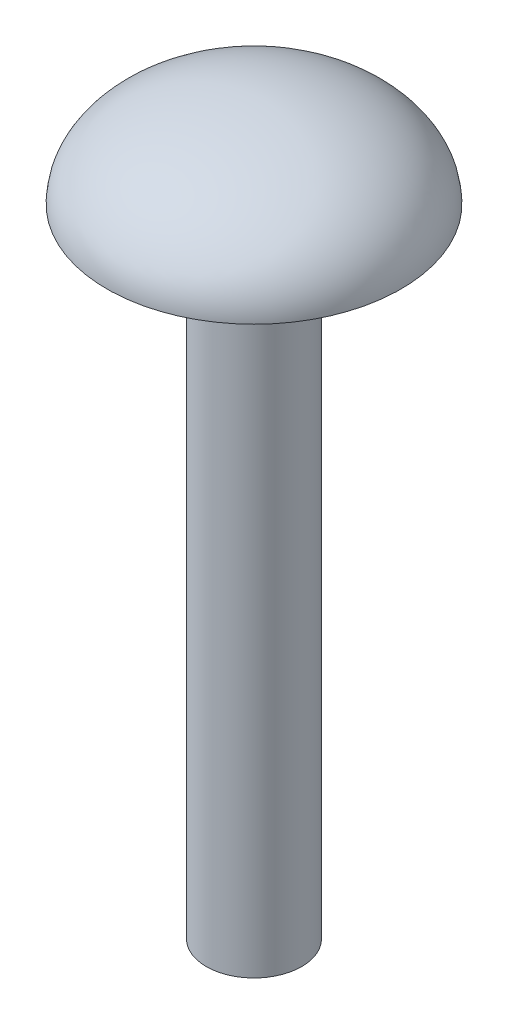
ISO-10303-21;
HEADER;
FILE_DESCRIPTION(('STEP AP214'),'2;1');
FILE_NAME('part.step','',(''),(''),'','','');
FILE_SCHEMA(('AUTOMOTIVE_DESIGN { 1 0 10303 214 1 1 1 1 }'));
ENDSEC;
DATA;
#1=APPLICATION_CONTEXT('core data for automotive mechanical design processes');
#2=APPLICATION_PROTOCOL_DEFINITION('international standard','automotive_design',2000,#1);
#3=PRODUCT_CONTEXT('',#1,'mechanical');
#4=PRODUCT('Part','Part','',(#3));
#5=PRODUCT_RELATED_PRODUCT_CATEGORY('part','',(#4));
#6=PRODUCT_DEFINITION_FORMATION('','',#4);
#7=PRODUCT_DEFINITION_CONTEXT('part definition',#1,'design');
#8=PRODUCT_DEFINITION('design','',#6,#7);
#9=PRODUCT_DEFINITION_SHAPE('','',#8);
#10=(LENGTH_UNIT() NAMED_UNIT(*) SI_UNIT(.MILLI.,.METRE.));
#11=(NAMED_UNIT(*) PLANE_ANGLE_UNIT() SI_UNIT($,.RADIAN.));
#12=(NAMED_UNIT(*) SI_UNIT($,.STERADIAN.) SOLID_ANGLE_UNIT());
#13=UNCERTAINTY_MEASURE_WITH_UNIT(LENGTH_MEASURE(1.E-05),#10,'distance_accuracy_value','');
#14=(GEOMETRIC_REPRESENTATION_CONTEXT(3) GLOBAL_UNCERTAINTY_ASSIGNED_CONTEXT((#13)) GLOBAL_UNIT_ASSIGNED_CONTEXT((#10,
#11,#12)) REPRESENTATION_CONTEXT('',''));
#15=CARTESIAN_POINT('',(0.,0.,0.));
#16=DIRECTION('',(0.,0.,1.));
#17=DIRECTION('',(1.,0.,0.));
#18=AXIS2_PLACEMENT_3D('',#15,#16,#17);
#19=CARTESIAN_POINT('',(0.,0.,0.));
#20=DIRECTION('',(0.,0.,1.));
#21=DIRECTION('',(-1.,0.,0.));
#22=AXIS2_PLACEMENT_3D('',#19,#20,#21);
#23=ELLIPSE('',#22,4.62,2.81);
#24=TRIMMED_CURVE('',#23,(PARAMETER_VALUE(4.71238898038469)),
(PARAMETER_VALUE(7.85398163397448)),.T.,.PARAMETER.);
#25=CARTESIAN_POINT('',(0.,0.,0.));
#26=DIRECTION('',(0.,-1.,0.));
#27=AXIS1_PLACEMENT('',#25,#26);
#28=SURFACE_OF_REVOLUTION('',#24,#27);
#29=CARTESIAN_POINT('',(0.,0.,0.));
#30=DIRECTION('',(0.,-1.,0.));
#31=DIRECTION('',(0.,0.,-1.));
#32=AXIS2_PLACEMENT_3D('',#29,#30,#31);
#33=CIRCLE('',#32,4.62);
#34=CARTESIAN_POINT('',(0.,0.,-4.62));
#35=VERTEX_POINT('',#34);
#36=EDGE_CURVE('E11',#35,#35,#33,.T.);
#37=ORIENTED_EDGE('',*,*,#36,.F.);
#38=EDGE_LOOP('',(#37));
#39=FACE_BOUND('',#38,.T.);
#40=CARTESIAN_POINT('',(0.,2.81,0.));
#41=VERTEX_POINT('',#40);
#42=VERTEX_LOOP('',#41);
#43=FACE_BOUND('',#42,.T.);
#44=ADVANCED_FACE('F37',(#39,#43),#28,.T.);
#45=CARTESIAN_POINT('',(-4.62,0.,0.));
#46=DIRECTION('',(0.,1.,0.));
#47=DIRECTION('',(0.,0.,1.));
#48=AXIS2_PLACEMENT_3D('',#45,#46,#47);
#49=PLANE('',#48);
#50=CARTESIAN_POINT('',(0.,0.,0.));
#51=DIRECTION('',(0.,1.,0.));
#52=DIRECTION('',(0.,0.,1.));
#53=AXIS2_PLACEMENT_3D('',#50,#51,#52);
#54=CIRCLE('',#53,1.49972818377824);
#55=CARTESIAN_POINT('',(0.,0.,1.49972818377824));
#56=VERTEX_POINT('',#55);
#57=EDGE_CURVE('E70',#56,#56,#54,.T.);
#58=ORIENTED_EDGE('',*,*,#57,.T.);
#59=EDGE_LOOP('',(#58));
#60=FACE_BOUND('',#59,.T.);
#61=ORIENTED_EDGE('',*,*,#36,.T.);
#62=EDGE_LOOP('',(#61));
#63=FACE_BOUND('',#62,.T.);
#64=ADVANCED_FACE('F47',(#60,#63),#49,.F.);
#65=CARTESIAN_POINT('',(0.,-20.,0.));
#66=DIRECTION('',(0.,1.,0.));
#67=DIRECTION('',(0.,0.,1.));
#68=AXIS2_PLACEMENT_3D('',#65,#66,#67);
#69=CYLINDRICAL_SURFACE('',#68,1.49972818377824);
#70=CARTESIAN_POINT('',(0.,-20.,0.));
#71=DIRECTION('',(0.,1.,0.));
#72=DIRECTION('',(0.,0.,1.));
#73=AXIS2_PLACEMENT_3D('',#70,#71,#72);
#74=CIRCLE('',#73,1.49972818377824);
#75=CARTESIAN_POINT('',(0.,-20.,1.49972818377824));
#76=VERTEX_POINT('',#75);
#77=EDGE_CURVE('E43',#76,#76,#74,.T.);
#78=ORIENTED_EDGE('',*,*,#77,.T.);
#79=EDGE_LOOP('',(#78));
#80=FACE_BOUND('',#79,.T.);
#81=ORIENTED_EDGE('',*,*,#57,.F.);
#82=EDGE_LOOP('',(#81));
#83=FACE_BOUND('',#82,.T.);
#84=ADVANCED_FACE('F52',(#80,#83),#69,.T.);
#85=CARTESIAN_POINT('',(0.,-20.,0.));
#86=DIRECTION('',(0.,1.,0.));
#87=DIRECTION('',(0.,0.,1.));
#88=AXIS2_PLACEMENT_3D('',#85,#86,#87);
#89=PLANE('',#88);
#90=ORIENTED_EDGE('',*,*,#77,.F.);
#91=EDGE_LOOP('',(#90));
#92=FACE_BOUND('',#91,.T.);
#93=ADVANCED_FACE('F59',(#92),#89,.F.);
#94=CLOSED_SHELL('',(#44,#64,#84,#93));
#95=MANIFOLD_SOLID_BREP('B2',#94);
#96=ADVANCED_BREP_SHAPE_REPRESENTATION('',(#18,#95),#14);
#97=SHAPE_DEFINITION_REPRESENTATION(#9,#96);
ENDSEC;
END-ISO-10303-21;
